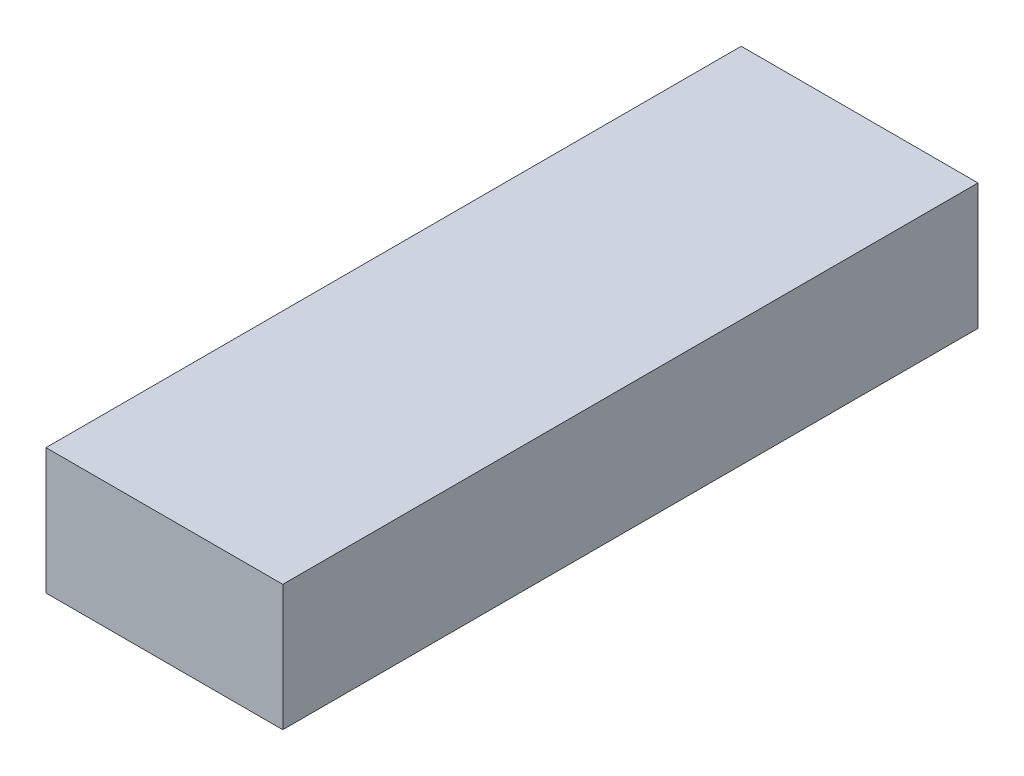
ISO-10303-21;
HEADER;
FILE_DESCRIPTION(('STEP AP214'),'2;1');
FILE_NAME('part.step','',(''),(''),'','','');
FILE_SCHEMA(('AUTOMOTIVE_DESIGN { 1 0 10303 214 1 1 1 1 }'));
ENDSEC;
DATA;
#1=APPLICATION_CONTEXT('core data for automotive mechanical design processes');
#2=APPLICATION_PROTOCOL_DEFINITION('international standard','automotive_design',2000,#1);
#3=PRODUCT_CONTEXT('',#1,'mechanical');
#4=PRODUCT('Part','Part','',(#3));
#5=PRODUCT_RELATED_PRODUCT_CATEGORY('part','',(#4));
#6=PRODUCT_DEFINITION_FORMATION('','',#4);
#7=PRODUCT_DEFINITION_CONTEXT('part definition',#1,'design');
#8=PRODUCT_DEFINITION('design','',#6,#7);
#9=PRODUCT_DEFINITION_SHAPE('','',#8);
#10=(LENGTH_UNIT() NAMED_UNIT(*) SI_UNIT(.MILLI.,.METRE.));
#11=(NAMED_UNIT(*) PLANE_ANGLE_UNIT() SI_UNIT($,.RADIAN.));
#12=(NAMED_UNIT(*) SI_UNIT($,.STERADIAN.) SOLID_ANGLE_UNIT());
#13=UNCERTAINTY_MEASURE_WITH_UNIT(LENGTH_MEASURE(1.E-05),#10,'distance_accuracy_value','');
#14=(GEOMETRIC_REPRESENTATION_CONTEXT(3) GLOBAL_UNCERTAINTY_ASSIGNED_CONTEXT((#13)) GLOBAL_UNIT_ASSIGNED_CONTEXT((#10,
#11,#12)) REPRESENTATION_CONTEXT('',''));
#15=CARTESIAN_POINT('',(0.,0.,0.));
#16=DIRECTION('',(0.,0.,1.));
#17=DIRECTION('',(1.,0.,0.));
#18=AXIS2_PLACEMENT_3D('',#15,#16,#17);
#19=CARTESIAN_POINT('',(23.5000000000004,25.,69.));
#20=DIRECTION('',(-1.,0.,0.));
#21=DIRECTION('',(0.,0.,1.));
#22=AXIS2_PLACEMENT_3D('',#19,#20,#21);
#23=PLANE('',#22);
#24=DIRECTION('',(0.,0.,-1.));
#25=VECTOR('',#24,1.);
#26=CARTESIAN_POINT('',(23.5000000000004,0.,69.));
#27=LINE('',#26,#25);
#28=CARTESIAN_POINT('',(23.5000000000004,0.,69.));
#29=VERTEX_POINT('',#28);
#30=CARTESIAN_POINT('',(23.5000000000004,0.,-69.));
#31=VERTEX_POINT('',#30);
#32=EDGE_CURVE('E107',#29,#31,#27,.T.);
#33=ORIENTED_EDGE('',*,*,#32,.T.);
#34=DIRECTION('',(0.,-1.,0.));
#35=VECTOR('',#34,1.);
#36=CARTESIAN_POINT('',(23.5000000000004,25.,-69.));
#37=LINE('',#36,#35);
#38=CARTESIAN_POINT('',(23.5000000000004,25.,-69.));
#39=VERTEX_POINT('',#38);
#40=EDGE_CURVE('E11',#39,#31,#37,.T.);
#41=ORIENTED_EDGE('',*,*,#40,.F.);
#42=DIRECTION('',(0.,0.,-1.));
#43=VECTOR('',#42,1.);
#44=CARTESIAN_POINT('',(23.5000000000004,25.,69.));
#45=LINE('',#44,#43);
#46=CARTESIAN_POINT('',(23.5000000000004,25.,69.));
#47=VERTEX_POINT('',#46);
#48=EDGE_CURVE('E91',#47,#39,#45,.T.);
#49=ORIENTED_EDGE('',*,*,#48,.F.);
#50=DIRECTION('',(0.,-1.,0.));
#51=VECTOR('',#50,1.);
#52=CARTESIAN_POINT('',(23.5000000000004,25.,69.));
#53=LINE('',#52,#51);
#54=EDGE_CURVE('E103',#47,#29,#53,.T.);
#55=ORIENTED_EDGE('',*,*,#54,.T.);
#56=EDGE_LOOP('',(#33,#41,#49,#55));
#57=FACE_BOUND('',#56,.T.);
#58=ADVANCED_FACE('F39',(#57),#23,.F.);
#59=CARTESIAN_POINT('',(-23.4999999999997,25.,-69.));
#60=DIRECTION('',(0.,0.,1.));
#61=DIRECTION('',(1.,0.,0.));
#62=AXIS2_PLACEMENT_3D('',#59,#60,#61);
#63=PLANE('',#62);
#64=DIRECTION('',(-1.,0.,0.));
#65=VECTOR('',#64,1.);
#66=CARTESIAN_POINT('',(-23.4999999999997,0.,-69.));
#67=LINE('',#66,#65);
#68=CARTESIAN_POINT('',(-23.4999999999997,0.,-69.));
#69=VERTEX_POINT('',#68);
#70=EDGE_CURVE('E96',#31,#69,#67,.T.);
#71=ORIENTED_EDGE('',*,*,#70,.T.);
#72=DIRECTION('',(0.,-1.,0.));
#73=VECTOR('',#72,1.);
#74=CARTESIAN_POINT('',(-23.4999999999997,25.,-69.));
#75=LINE('',#74,#73);
#76=CARTESIAN_POINT('',(-23.4999999999997,25.,-69.));
#77=VERTEX_POINT('',#76);
#78=EDGE_CURVE('E48',#77,#69,#75,.T.);
#79=ORIENTED_EDGE('',*,*,#78,.F.);
#80=DIRECTION('',(-1.,0.,0.));
#81=VECTOR('',#80,1.);
#82=CARTESIAN_POINT('',(-23.4999999999997,25.,-69.));
#83=LINE('',#82,#81);
#84=EDGE_CURVE('E86',#39,#77,#83,.T.);
#85=ORIENTED_EDGE('',*,*,#84,.F.);
#86=ORIENTED_EDGE('',*,*,#40,.T.);
#87=EDGE_LOOP('',(#71,#79,#85,#86));
#88=FACE_BOUND('',#87,.T.);
#89=ADVANCED_FACE('F95',(#88),#63,.F.);
#90=CARTESIAN_POINT('',(-23.4999999999997,25.,69.));
#91=DIRECTION('',(1.,0.,0.));
#92=DIRECTION('',(0.,0.,-1.));
#93=AXIS2_PLACEMENT_3D('',#90,#91,#92);
#94=PLANE('',#93);
#95=DIRECTION('',(0.,0.,1.));
#96=VECTOR('',#95,1.);
#97=CARTESIAN_POINT('',(-23.4999999999997,0.,69.));
#98=LINE('',#97,#96);
#99=CARTESIAN_POINT('',(-23.4999999999997,0.,69.));
#100=VERTEX_POINT('',#99);
#101=EDGE_CURVE('E73',#69,#100,#98,.T.);
#102=ORIENTED_EDGE('',*,*,#101,.T.);
#103=DIRECTION('',(0.,-1.,0.));
#104=VECTOR('',#103,1.);
#105=CARTESIAN_POINT('',(-23.4999999999997,25.,69.));
#106=LINE('',#105,#104);
#107=CARTESIAN_POINT('',(-23.4999999999997,25.,69.));
#108=VERTEX_POINT('',#107);
#109=EDGE_CURVE('E98',#108,#100,#106,.T.);
#110=ORIENTED_EDGE('',*,*,#109,.F.);
#111=DIRECTION('',(0.,0.,1.));
#112=VECTOR('',#111,1.);
#113=CARTESIAN_POINT('',(-23.4999999999997,25.,69.));
#114=LINE('',#113,#112);
#115=EDGE_CURVE('E89',#77,#108,#114,.T.);
#116=ORIENTED_EDGE('',*,*,#115,.F.);
#117=ORIENTED_EDGE('',*,*,#78,.T.);
#118=EDGE_LOOP('',(#102,#110,#116,#117));
#119=FACE_BOUND('',#118,.T.);
#120=ADVANCED_FACE('F99',(#119),#94,.F.);
#121=CARTESIAN_POINT('',(-23.4999999999997,25.,69.));
#122=DIRECTION('',(0.,0.,-1.));
#123=DIRECTION('',(-1.,0.,0.));
#124=AXIS2_PLACEMENT_3D('',#121,#122,#123);
#125=PLANE('',#124);
#126=DIRECTION('',(1.,0.,0.));
#127=VECTOR('',#126,1.);
#128=CARTESIAN_POINT('',(-23.4999999999997,0.,69.));
#129=LINE('',#128,#127);
#130=EDGE_CURVE('E79',#100,#29,#129,.T.);
#131=ORIENTED_EDGE('',*,*,#130,.T.);
#132=ORIENTED_EDGE('',*,*,#54,.F.);
#133=DIRECTION('',(1.,0.,0.));
#134=VECTOR('',#133,1.);
#135=CARTESIAN_POINT('',(-23.4999999999997,25.,69.));
#136=LINE('',#135,#134);
#137=EDGE_CURVE('E56',#108,#47,#136,.T.);
#138=ORIENTED_EDGE('',*,*,#137,.F.);
#139=ORIENTED_EDGE('',*,*,#109,.T.);
#140=EDGE_LOOP('',(#131,#132,#138,#139));
#141=FACE_BOUND('',#140,.T.);
#142=ADVANCED_FACE('F120',(#141),#125,.F.);
#143=CARTESIAN_POINT('',(0.,25.,0.));
#144=DIRECTION('',(0.,-1.,0.));
#145=DIRECTION('',(0.,0.,-1.));
#146=AXIS2_PLACEMENT_3D('',#143,#144,#145);
#147=PLANE('',#146);
#148=ORIENTED_EDGE('',*,*,#48,.T.);
#149=ORIENTED_EDGE('',*,*,#84,.T.);
#150=ORIENTED_EDGE('',*,*,#115,.T.);
#151=ORIENTED_EDGE('',*,*,#137,.T.);
#152=EDGE_LOOP('',(#148,#149,#150,#151));
#153=FACE_BOUND('',#152,.T.);
#154=ADVANCED_FACE('F87',(#153),#147,.F.);
#155=CARTESIAN_POINT('',(0.,0.,0.));
#156=DIRECTION('',(0.,-1.,0.));
#157=DIRECTION('',(0.,0.,-1.));
#158=AXIS2_PLACEMENT_3D('',#155,#156,#157);
#159=PLANE('',#158);
#160=ORIENTED_EDGE('',*,*,#32,.F.);
#161=ORIENTED_EDGE('',*,*,#130,.F.);
#162=ORIENTED_EDGE('',*,*,#101,.F.);
#163=ORIENTED_EDGE('',*,*,#70,.F.);
#164=EDGE_LOOP('',(#160,#161,#162,#163));
#165=FACE_BOUND('',#164,.T.);
#166=ADVANCED_FACE('F123',(#165),#159,.T.);
#167=CLOSED_SHELL('',(#58,#89,#120,#142,#154,#166));
#168=MANIFOLD_SOLID_BREP('B2',#167);
#169=ADVANCED_BREP_SHAPE_REPRESENTATION('',(#18,#168),#14);
#170=SHAPE_DEFINITION_REPRESENTATION(#9,#169);
ENDSEC;
END-ISO-10303-21;
